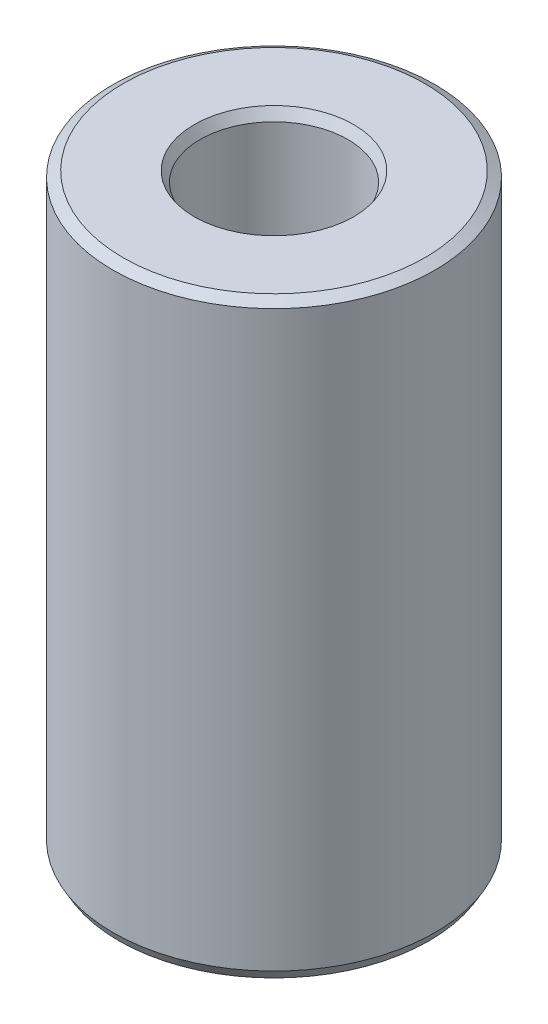
ISO-10303-21;
HEADER;
FILE_DESCRIPTION(('STEP AP214'),'2;1');
FILE_NAME('part.step','',(''),(''),'','','');
FILE_SCHEMA(('AUTOMOTIVE_DESIGN { 1 0 10303 214 1 1 1 1 }'));
ENDSEC;
DATA;
#1=APPLICATION_CONTEXT('core data for automotive mechanical design processes');
#2=APPLICATION_PROTOCOL_DEFINITION('international standard','automotive_design',2000,#1);
#3=PRODUCT_CONTEXT('',#1,'mechanical');
#4=PRODUCT('Part','Part','',(#3));
#5=PRODUCT_RELATED_PRODUCT_CATEGORY('part','',(#4));
#6=PRODUCT_DEFINITION_FORMATION('','',#4);
#7=PRODUCT_DEFINITION_CONTEXT('part definition',#1,'design');
#8=PRODUCT_DEFINITION('design','',#6,#7);
#9=PRODUCT_DEFINITION_SHAPE('','',#8);
#10=(LENGTH_UNIT() NAMED_UNIT(*) SI_UNIT(.MILLI.,.METRE.));
#11=(NAMED_UNIT(*) PLANE_ANGLE_UNIT() SI_UNIT($,.RADIAN.));
#12=(NAMED_UNIT(*) SI_UNIT($,.STERADIAN.) SOLID_ANGLE_UNIT());
#13=UNCERTAINTY_MEASURE_WITH_UNIT(LENGTH_MEASURE(1.E-05),#10,'distance_accuracy_value','');
#14=(GEOMETRIC_REPRESENTATION_CONTEXT(3) GLOBAL_UNCERTAINTY_ASSIGNED_CONTEXT((#13)) GLOBAL_UNIT_ASSIGNED_CONTEXT((#10,
#11,#12)) REPRESENTATION_CONTEXT('',''));
#15=CARTESIAN_POINT('',(0.,0.,0.));
#16=DIRECTION('',(0.,0.,1.));
#17=DIRECTION('',(1.,0.,0.));
#18=AXIS2_PLACEMENT_3D('',#15,#16,#17);
#19=CARTESIAN_POINT('',(0.,201.543631725052,0.));
#20=DIRECTION('',(0.,-1.,0.));
#21=DIRECTION('',(0.,0.,-1.));
#22=AXIS2_PLACEMENT_3D('',#19,#20,#21);
#23=CYLINDRICAL_SURFACE('',#22,55.);
#24=CARTESIAN_POINT('',(0.,3.42882981997944,0.));
#25=DIRECTION('',(0.,1.,0.));
#26=DIRECTION('',(0.,0.,1.));
#27=AXIS2_PLACEMENT_3D('',#24,#25,#26);
#28=CIRCLE('',#27,55.);
#29=CARTESIAN_POINT('',(0.,3.42882981997944,55.));
#30=VERTEX_POINT('',#29);
#31=EDGE_CURVE('E10',#30,#30,#28,.T.);
#32=ORIENTED_EDGE('',*,*,#31,.T.);
#33=EDGE_LOOP('',(#32));
#34=FACE_BOUND('',#33,.T.);
#35=CARTESIAN_POINT('',(0.,199.563995905481,0.));
#36=DIRECTION('',(0.,1.,0.));
#37=DIRECTION('',(0.,0.,1.));
#38=AXIS2_PLACEMENT_3D('',#35,#36,#37);
#39=CIRCLE('',#38,55.);
#40=CARTESIAN_POINT('',(0.,199.563995905481,55.));
#41=VERTEX_POINT('',#40);
#42=EDGE_CURVE('E50',#41,#41,#39,.F.);
#43=ORIENTED_EDGE('',*,*,#42,.T.);
#44=EDGE_LOOP('',(#43));
#45=FACE_BOUND('',#44,.T.);
#46=ADVANCED_FACE('F39',(#34,#45),#23,.T.);
#47=CARTESIAN_POINT('',(0.,201.543631725052,0.));
#48=DIRECTION('',(0.,1.,0.));
#49=DIRECTION('',(0.,0.,1.));
#50=AXIS2_PLACEMENT_3D('',#47,#48,#49);
#51=PLANE('',#50);
#52=CARTESIAN_POINT('',(0.,201.543631725052,0.));
#53=DIRECTION('',(0.,1.,0.));
#54=DIRECTION('',(0.,0.,1.));
#55=AXIS2_PLACEMENT_3D('',#52,#53,#54);
#56=CIRCLE('',#55,27.2853913423851);
#57=CARTESIAN_POINT('',(0.,201.543631725052,27.2853913423851));
#58=VERTEX_POINT('',#57);
#59=EDGE_CURVE('E58',#58,#58,#56,.F.);
#60=ORIENTED_EDGE('',*,*,#59,.T.);
#61=EDGE_LOOP('',(#60));
#62=FACE_BOUND('',#61,.T.);
#63=CARTESIAN_POINT('',(0.,201.543631725052,0.));
#64=DIRECTION('',(0.,1.,0.));
#65=DIRECTION('',(0.,0.,1.));
#66=AXIS2_PLACEMENT_3D('',#63,#64,#65);
#67=CIRCLE('',#66,51.5711701800206);
#68=CARTESIAN_POINT('',(0.,201.543631725052,51.5711701800206));
#69=VERTEX_POINT('',#68);
#70=EDGE_CURVE('E61',#69,#69,#67,.T.);
#71=ORIENTED_EDGE('',*,*,#70,.T.);
#72=EDGE_LOOP('',(#71));
#73=FACE_BOUND('',#72,.T.);
#74=ADVANCED_FACE('F88',(#62,#73),#51,.T.);
#75=CARTESIAN_POINT('',(0.,0.,0.));
#76=DIRECTION('',(0.,1.,0.));
#77=DIRECTION('',(0.,0.,1.));
#78=AXIS2_PLACEMENT_3D('',#75,#76,#77);
#79=PLANE('',#78);
#80=CARTESIAN_POINT('',(0.,0.,0.));
#81=DIRECTION('',(0.,1.,0.));
#82=DIRECTION('',(0.,0.,1.));
#83=AXIS2_PLACEMENT_3D('',#80,#81,#82);
#84=CIRCLE('',#83,28.7345853427941);
#85=CARTESIAN_POINT('',(0.,0.,28.7345853427941));
#86=VERTEX_POINT('',#85);
#87=EDGE_CURVE('E51',#86,#86,#84,.T.);
#88=ORIENTED_EDGE('',*,*,#87,.T.);
#89=EDGE_LOOP('',(#88));
#90=FACE_BOUND('',#89,.T.);
#91=CARTESIAN_POINT('',(0.,0.,0.));
#92=DIRECTION('',(0.,1.,0.));
#93=DIRECTION('',(0.,0.,1.));
#94=AXIS2_PLACEMENT_3D('',#91,#92,#93);
#95=CIRCLE('',#94,53.0203641804295);
#96=CARTESIAN_POINT('',(0.,0.,53.0203641804295));
#97=VERTEX_POINT('',#96);
#98=EDGE_CURVE('E54',#97,#97,#95,.F.);
#99=ORIENTED_EDGE('',*,*,#98,.T.);
#100=EDGE_LOOP('',(#99));
#101=FACE_BOUND('',#100,.T.);
#102=ADVANCED_FACE('F83',(#90,#101),#79,.F.);
#103=CARTESIAN_POINT('',(0.,201.543631725052,0.));
#104=DIRECTION('',(0.,-1.,0.));
#105=DIRECTION('',(0.,0.,-1.));
#106=AXIS2_PLACEMENT_3D('',#103,#104,#105);
#107=CYLINDRICAL_SURFACE('',#106,25.3057555228146);
#108=CARTESIAN_POINT('',(0.,198.114801905072,0.));
#109=DIRECTION('',(0.,1.,0.));
#110=DIRECTION('',(0.,0.,1.));
#111=AXIS2_PLACEMENT_3D('',#108,#109,#110);
#112=CIRCLE('',#111,25.3057555228146);
#113=CARTESIAN_POINT('',(0.,198.114801905072,25.3057555228146));
#114=VERTEX_POINT('',#113);
#115=EDGE_CURVE('E67',#114,#114,#112,.T.);
#116=ORIENTED_EDGE('',*,*,#115,.T.);
#117=EDGE_LOOP('',(#116));
#118=FACE_BOUND('',#117,.T.);
#119=CARTESIAN_POINT('',(0.,1.97963581957061,0.));
#120=DIRECTION('',(0.,1.,0.));
#121=DIRECTION('',(0.,0.,1.));
#122=AXIS2_PLACEMENT_3D('',#119,#120,#121);
#123=CIRCLE('',#122,25.3057555228146);
#124=CARTESIAN_POINT('',(0.,1.97963581957061,25.3057555228146));
#125=VERTEX_POINT('',#124);
#126=EDGE_CURVE('E69',#125,#125,#123,.F.);
#127=ORIENTED_EDGE('',*,*,#126,.T.);
#128=EDGE_LOOP('',(#127));
#129=FACE_BOUND('',#128,.T.);
#130=ADVANCED_FACE('F71',(#118,#129),#107,.F.);
#131=CARTESIAN_POINT('',(0.,198.114801905072,0.));
#132=DIRECTION('',(0.,1.,0.));
#133=DIRECTION('',(0.,0.,1.));
#134=AXIS2_PLACEMENT_3D('',#131,#132,#133);
#135=CONICAL_SURFACE('',#134,25.3057555228146,0.523598775598302);
#136=CARTESIAN_POINT('',(0.,201.543631725052,27.2853913423851));
#137=CARTESIAN_POINT('',(0.,201.50791474776,27.2647701359313));
#138=CARTESIAN_POINT('',(0.,201.472197770469,27.2441489294774));
#139=CARTESIAN_POINT('',(0.,201.400763815886,27.2029065165697));
#140=CARTESIAN_POINT('',(0.,201.365046838595,27.1822853101158));
#141=CARTESIAN_POINT('',(0.,201.293612884012,27.1410428972081));
#142=CARTESIAN_POINT('',(0.,201.25789590672,27.1204216907543));
#143=CARTESIAN_POINT('',(0.,201.186461952137,27.0791792778465));
#144=CARTESIAN_POINT('',(0.,201.150744974846,27.0585580713927));
#145=CARTESIAN_POINT('',(0.,201.079311020263,27.017315658485));
#146=CARTESIAN_POINT('',(0.,201.043594042972,26.9966944520311));
#147=CARTESIAN_POINT('',(0.,200.972160088389,26.9554520391234));
#148=CARTESIAN_POINT('',(0.,200.936443111097,26.9348308326695));
#149=CARTESIAN_POINT('',(0.,200.865009156514,26.8935884197618));
#150=CARTESIAN_POINT('',(0.,200.829292179223,26.8729672133079));
#151=CARTESIAN_POINT('',(0.,200.75785822464,26.8317248004002));
#152=CARTESIAN_POINT('',(0.,200.722141247348,26.8111035939464));
#153=CARTESIAN_POINT('',(0.,200.650707292766,26.7698611810386));
#154=CARTESIAN_POINT('',(0.,200.614990315474,26.7492399745848));
#155=CARTESIAN_POINT('',(0.,200.543556360891,26.7079975616771));
#156=CARTESIAN_POINT('',(0.,200.5078393836,26.6873763552232));
#157=CARTESIAN_POINT('',(0.,200.436405429017,26.6461339423155));
#158=CARTESIAN_POINT('',(0.,200.400688451725,26.6255127358616));
#159=CARTESIAN_POINT('',(0.,200.329254497142,26.5842703229539));
#160=CARTESIAN_POINT('',(0.,200.293537519851,26.5636491165001));
#161=CARTESIAN_POINT('',(0.,200.222103565268,26.5224067035923));
#162=CARTESIAN_POINT('',(0.,200.186386587977,26.5017854971385));
#163=CARTESIAN_POINT('',(0.,200.114952633394,26.4605430842307));
#164=CARTESIAN_POINT('',(0.,200.079235656102,26.4399218777769));
#165=CARTESIAN_POINT('',(0.,200.007801701519,26.3986794648692));
#166=CARTESIAN_POINT('',(0.,199.972084724228,26.3780582584153));
#167=CARTESIAN_POINT('',(0.,199.900650769645,26.3368158455076));
#168=CARTESIAN_POINT('',(0.,199.864933792354,26.3161946390537));
#169=CARTESIAN_POINT('',(0.,199.793499837771,26.274952226146));
#170=CARTESIAN_POINT('',(0.,199.757782860479,26.2543310196922));
#171=CARTESIAN_POINT('',(0.,199.686348905896,26.2130886067844));
#172=CARTESIAN_POINT('',(0.,199.650631928605,26.1924674003306));
#173=CARTESIAN_POINT('',(0.,199.579197974022,26.1512249874229));
#174=CARTESIAN_POINT('',(0.,199.543480996731,26.130603780969));
#175=CARTESIAN_POINT('',(0.,199.472047042148,26.0893613680613));
#176=CARTESIAN_POINT('',(0.,199.436330064856,26.0687401616074));
#177=CARTESIAN_POINT('',(0.,199.364896110273,26.0274977486997));
#178=CARTESIAN_POINT('',(0.,199.329179132982,26.0068765422458));
#179=CARTESIAN_POINT('',(0.,199.257745178399,25.9656341293381));
#180=CARTESIAN_POINT('',(0.,199.222028201107,25.9450129228843));
#181=CARTESIAN_POINT('',(0.,199.150594246525,25.9037705099765));
#182=CARTESIAN_POINT('',(0.,199.114877269233,25.8831493035227));
#183=CARTESIAN_POINT('',(0.,199.04344331465,25.841906890615));
#184=CARTESIAN_POINT('',(0.,199.007726337359,25.8212856841611));
#185=CARTESIAN_POINT('',(0.,198.936292382776,25.7800432712534));
#186=CARTESIAN_POINT('',(0.,198.900575405484,25.7594220647995));
#187=CARTESIAN_POINT('',(0.,198.829141450901,25.7181796518918));
#188=CARTESIAN_POINT('',(0.,198.79342447361,25.6975584454379));
#189=CARTESIAN_POINT('',(0.,198.721990519027,25.6563160325302));
#190=CARTESIAN_POINT('',(0.,198.686273541736,25.6356948260764));
#191=CARTESIAN_POINT('',(0.,198.614839587153,25.5944524131687));
#192=CARTESIAN_POINT('',(0.,198.579122609861,25.5738312067148));
#193=CARTESIAN_POINT('',(0.,198.507688655278,25.5325887938071));
#194=CARTESIAN_POINT('',(0.,198.471971677987,25.5119675873532));
#195=CARTESIAN_POINT('',(0.,198.400537723404,25.4707251744455));
#196=CARTESIAN_POINT('',(0.,198.364820746113,25.4501039679916));
#197=CARTESIAN_POINT('',(0.,198.29338679153,25.4088615550839));
#198=CARTESIAN_POINT('',(0.,198.257669814238,25.3882403486301));
#199=CARTESIAN_POINT('',(0.,198.186235859655,25.3469979357223));
#200=CARTESIAN_POINT('',(0.,198.150518882364,25.3263767292685));
#201=CARTESIAN_POINT('',(0.,198.114801905072,25.3057555228146));
#202=B_SPLINE_CURVE_WITH_KNOTS('',3,(#136,#137,#138,#139,#140,#141,#142,#143,#144,#145,#146,
#147,#148,#149,#150,#151,#152,#153,#154,#155,#156,#157,#158,#159,#160,#161,#162,#163,#164,#165,
#166,#167,#168,#169,#170,#171,#172,#173,#174,#175,#176,#177,#178,#179,#180,#181,#182,#183,#184,
#185,#186,#187,#188,#189,#190,#191,#192,#193,#194,#195,#196,#197,#198,#199,#200,#201),
.UNSPECIFIED.,.F.,.F.,(4,2,2,2,2,2,2,2,2,2,2,2,2,2,2,2,2,2,2,2,2,2,2,2,2,2,2,2,2,2,2,2,4),(0.,
0.123727238723133,0.24745447744629,0.371181716169448,0.494908954892605,0.618636193615762,
0.742363432338919,0.866090671062076,0.989817909785233,1.11354514850839,1.23727238723155,
1.3609996259547,1.48472686467786,1.60845410340102,1.73218134212418,1.85590858084733,
1.97963581957049,2.10336305829365,2.2270902970168,2.35081753573996,2.47454477446312,
2.59827201318627,2.72199925190943,2.84572649063259,2.96945372935575,3.0931809680789,
3.21690820680206,3.34063544552522,3.46436268424837,3.58808992297153,3.71181716169469,
3.83554440041784,3.95927163914098),.UNSPECIFIED.);
#203=EDGE_CURVE('BSEAM77',#58,#114,#202,.T.);
#204=ORIENTED_EDGE('',*,*,#59,.F.);
#205=ORIENTED_EDGE('',*,*,#115,.F.);
#206=ORIENTED_EDGE('',*,*,#203,.T.);
#207=ORIENTED_EDGE('',*,*,#203,.F.);
#208=EDGE_LOOP('',(#204,#206,#205,#207));
#209=FACE_BOUND('',#208,.T.);
#210=ADVANCED_FACE('F77',(#209),#135,.F.);
#211=CARTESIAN_POINT('',(0.,0.,0.));
#212=DIRECTION('',(0.,-1.,0.));
#213=DIRECTION('',(0.,0.,-1.));
#214=AXIS2_PLACEMENT_3D('',#211,#212,#213);
#215=CONICAL_SURFACE('',#214,28.7345853427941,1.04719755119659);
#216=ORIENTED_EDGE('',*,*,#126,.F.);
#217=EDGE_LOOP('',(#216));
#218=FACE_BOUND('',#217,.T.);
#219=ORIENTED_EDGE('',*,*,#87,.F.);
#220=EDGE_LOOP('',(#219));
#221=FACE_BOUND('',#220,.T.);
#222=ADVANCED_FACE('F73',(#218,#221),#215,.F.);
#223=CARTESIAN_POINT('',(0.,3.42882981997944,0.));
#224=DIRECTION('',(0.,1.,0.));
#225=DIRECTION('',(0.,0.,1.));
#226=AXIS2_PLACEMENT_3D('',#223,#224,#225);
#227=CONICAL_SURFACE('',#226,55.,0.523598775598297);
#228=ORIENTED_EDGE('',*,*,#98,.F.);
#229=EDGE_LOOP('',(#228));
#230=FACE_BOUND('',#229,.T.);
#231=ORIENTED_EDGE('',*,*,#31,.F.);
#232=EDGE_LOOP('',(#231));
#233=FACE_BOUND('',#232,.T.);
#234=ADVANCED_FACE('F76',(#230,#233),#227,.T.);
#235=CARTESIAN_POINT('',(0.,201.543631725052,0.));
#236=DIRECTION('',(0.,-1.,0.));
#237=DIRECTION('',(0.,0.,-1.));
#238=AXIS2_PLACEMENT_3D('',#235,#236,#237);
#239=CONICAL_SURFACE('',#238,51.5711701800206,1.0471975511966);
#240=ORIENTED_EDGE('',*,*,#42,.F.);
#241=EDGE_LOOP('',(#240));
#242=FACE_BOUND('',#241,.T.);
#243=ORIENTED_EDGE('',*,*,#70,.F.);
#244=EDGE_LOOP('',(#243));
#245=FACE_BOUND('',#244,.T.);
#246=ADVANCED_FACE('F45',(#242,#245),#239,.T.);
#247=CLOSED_SHELL('',(#46,#74,#102,#130,#210,#222,#234,#246));
#248=MANIFOLD_SOLID_BREP('B2',#247);
#249=ADVANCED_BREP_SHAPE_REPRESENTATION('',(#18,#248),#14);
#250=SHAPE_DEFINITION_REPRESENTATION(#9,#249);
ENDSEC;
END-ISO-10303-21;
